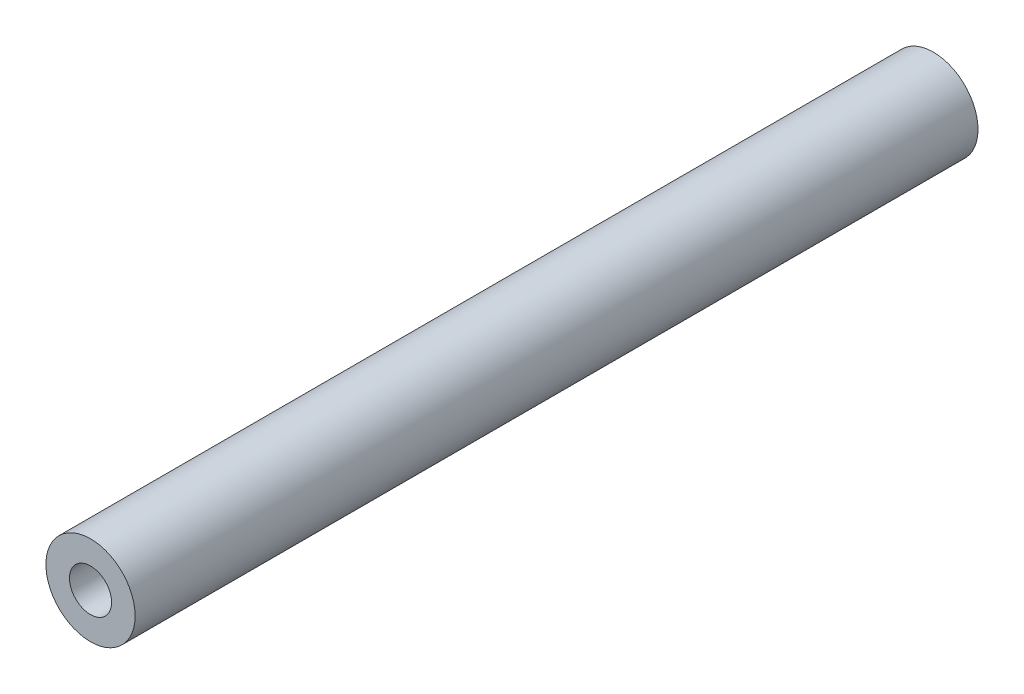
ISO-10303-21;
HEADER;
FILE_DESCRIPTION(('STEP AP214'),'2;1');
FILE_NAME('part.step','',(''),(''),'','','');
FILE_SCHEMA(('AUTOMOTIVE_DESIGN { 1 0 10303 214 1 1 1 1 }'));
ENDSEC;
DATA;
#1=APPLICATION_CONTEXT('core data for automotive mechanical design processes');
#2=APPLICATION_PROTOCOL_DEFINITION('international standard','automotive_design',2000,#1);
#3=PRODUCT_CONTEXT('',#1,'mechanical');
#4=PRODUCT('Part','Part','',(#3));
#5=PRODUCT_RELATED_PRODUCT_CATEGORY('part','',(#4));
#6=PRODUCT_DEFINITION_FORMATION('','',#4);
#7=PRODUCT_DEFINITION_CONTEXT('part definition',#1,'design');
#8=PRODUCT_DEFINITION('design','',#6,#7);
#9=PRODUCT_DEFINITION_SHAPE('','',#8);
#10=(LENGTH_UNIT() NAMED_UNIT(*) SI_UNIT(.MILLI.,.METRE.));
#11=(NAMED_UNIT(*) PLANE_ANGLE_UNIT() SI_UNIT($,.RADIAN.));
#12=(NAMED_UNIT(*) SI_UNIT($,.STERADIAN.) SOLID_ANGLE_UNIT());
#13=UNCERTAINTY_MEASURE_WITH_UNIT(LENGTH_MEASURE(1.E-05),#10,'distance_accuracy_value','');
#14=(GEOMETRIC_REPRESENTATION_CONTEXT(3) GLOBAL_UNCERTAINTY_ASSIGNED_CONTEXT((#13)) GLOBAL_UNIT_ASSIGNED_CONTEXT((#10,
#11,#12)) REPRESENTATION_CONTEXT('',''));
#15=CARTESIAN_POINT('',(0.,0.,0.));
#16=DIRECTION('',(0.,0.,1.));
#17=DIRECTION('',(1.,0.,0.));
#18=AXIS2_PLACEMENT_3D('',#15,#16,#17);
#19=CARTESIAN_POINT('',(0.,0.,17.1901280605346));
#20=DIRECTION('',(0.,0.,-1.));
#21=DIRECTION('',(-1.,0.,0.));
#22=AXIS2_PLACEMENT_3D('',#19,#20,#21);
#23=CYLINDRICAL_SURFACE('',#22,1.5875);
#24=CARTESIAN_POINT('',(0.,0.,-23.65));
#25=DIRECTION('',(0.,0.,1.));
#26=DIRECTION('',(1.,0.,0.));
#27=AXIS2_PLACEMENT_3D('',#24,#25,#26);
#28=CIRCLE('',#27,1.5875);
#29=CARTESIAN_POINT('',(1.5875,0.,-23.65));
#30=VERTEX_POINT('',#29);
#31=EDGE_CURVE('E39',#30,#30,#28,.F.);
#32=ORIENTED_EDGE('',*,*,#31,.F.);
#33=EDGE_LOOP('',(#32));
#34=FACE_BOUND('',#33,.T.);
#35=CARTESIAN_POINT('',(0.,0.,6.35));
#36=DIRECTION('',(0.,0.,1.));
#37=DIRECTION('',(1.,0.,0.));
#38=AXIS2_PLACEMENT_3D('',#35,#36,#37);
#39=CIRCLE('',#38,1.5875);
#40=CARTESIAN_POINT('',(1.5875,0.,6.35));
#41=VERTEX_POINT('',#40);
#42=EDGE_CURVE('E11',#41,#41,#39,.T.);
#43=ORIENTED_EDGE('',*,*,#42,.F.);
#44=EDGE_LOOP('',(#43));
#45=FACE_BOUND('',#44,.T.);
#46=ADVANCED_FACE('F32',(#34,#45),#23,.T.);
#47=CARTESIAN_POINT('',(0.,0.,6.35));
#48=DIRECTION('',(0.,0.,1.));
#49=DIRECTION('',(1.,0.,0.));
#50=AXIS2_PLACEMENT_3D('',#47,#48,#49);
#51=PLANE('',#50);
#52=CARTESIAN_POINT('',(0.,0.,6.35));
#53=DIRECTION('',(0.,0.,1.));
#54=DIRECTION('',(1.,0.,0.));
#55=AXIS2_PLACEMENT_3D('',#52,#53,#54);
#56=CIRCLE('',#55,0.750000024);
#57=CARTESIAN_POINT('',(0.750000024,0.,6.35));
#58=VERTEX_POINT('',#57);
#59=EDGE_CURVE('E47',#58,#58,#56,.T.);
#60=ORIENTED_EDGE('',*,*,#59,.F.);
#61=EDGE_LOOP('',(#60));
#62=FACE_BOUND('',#61,.T.);
#63=ORIENTED_EDGE('',*,*,#42,.T.);
#64=EDGE_LOOP('',(#63));
#65=FACE_BOUND('',#64,.T.);
#66=ADVANCED_FACE('F34',(#62,#65),#51,.T.);
#67=CARTESIAN_POINT('',(0.,0.,-23.65));
#68=DIRECTION('',(0.,0.,1.));
#69=DIRECTION('',(1.,0.,0.));
#70=AXIS2_PLACEMENT_3D('',#67,#68,#69);
#71=PLANE('',#70);
#72=ORIENTED_EDGE('',*,*,#31,.T.);
#73=EDGE_LOOP('',(#72));
#74=FACE_BOUND('',#73,.T.);
#75=ADVANCED_FACE('F56',(#74),#71,.F.);
#76=CARTESIAN_POINT('',(0.,0.,6.35));
#77=DIRECTION('',(0.,0.,1.));
#78=DIRECTION('',(1.,0.,0.));
#79=AXIS2_PLACEMENT_3D('',#76,#77,#78);
#80=CONICAL_SURFACE('',#79,0.750000024,0.0174532925199433);
#81=CARTESIAN_POINT('',(0.,0.,-6.35));
#82=DIRECTION('',(0.,0.,1.));
#83=DIRECTION('',(1.,0.,0.));
#84=AXIS2_PLACEMENT_3D('',#81,#82,#83);
#85=CIRCLE('',#84,0.528320699411636);
#86=CARTESIAN_POINT('',(0.528320699411636,0.,-6.35));
#87=VERTEX_POINT('',#86);
#88=EDGE_CURVE('E43',#87,#87,#85,.T.);
#89=ORIENTED_EDGE('',*,*,#88,.F.);
#90=EDGE_LOOP('',(#89));
#91=FACE_BOUND('',#90,.T.);
#92=ORIENTED_EDGE('',*,*,#59,.T.);
#93=EDGE_LOOP('',(#92));
#94=FACE_BOUND('',#93,.T.);
#95=ADVANCED_FACE('F53',(#91,#94),#80,.F.);
#96=CARTESIAN_POINT('',(0.,0.,-6.35));
#97=DIRECTION('',(0.,0.,1.));
#98=DIRECTION('',(1.,0.,0.));
#99=AXIS2_PLACEMENT_3D('',#96,#97,#98);
#100=PLANE('',#99);
#101=ORIENTED_EDGE('',*,*,#88,.T.);
#102=EDGE_LOOP('',(#101));
#103=FACE_BOUND('',#102,.T.);
#104=ADVANCED_FACE('F69',(#103),#100,.T.);
#105=CLOSED_SHELL('',(#46,#66,#75,#95,#104));
#106=MANIFOLD_SOLID_BREP('B2',#105);
#107=ADVANCED_BREP_SHAPE_REPRESENTATION('',(#18,#106),#14);
#108=SHAPE_DEFINITION_REPRESENTATION(#9,#107);
ENDSEC;
END-ISO-10303-21;
